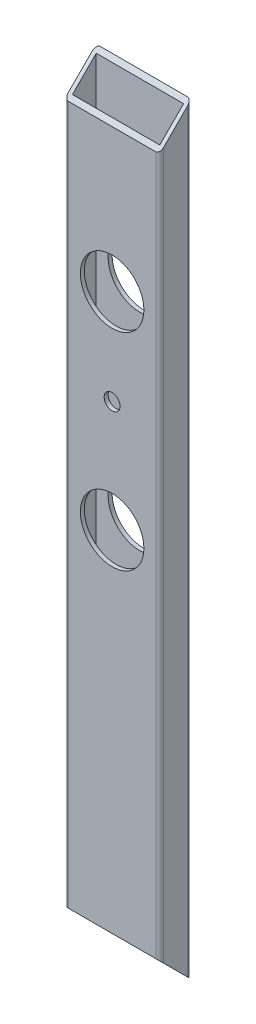
ISO-10303-21;
HEADER;
FILE_DESCRIPTION(('STEP AP214'),'2;1');
FILE_NAME('part.step','',(''),(''),'','','');
FILE_SCHEMA(('AUTOMOTIVE_DESIGN { 1 0 10303 214 1 1 1 1 }'));
ENDSEC;
DATA;
#1=APPLICATION_CONTEXT('core data for automotive mechanical design processes');
#2=APPLICATION_PROTOCOL_DEFINITION('international standard','automotive_design',2000,#1);
#3=PRODUCT_CONTEXT('',#1,'mechanical');
#4=PRODUCT('Part','Part','',(#3));
#5=PRODUCT_RELATED_PRODUCT_CATEGORY('part','',(#4));
#6=PRODUCT_DEFINITION_FORMATION('','',#4);
#7=PRODUCT_DEFINITION_CONTEXT('part definition',#1,'design');
#8=PRODUCT_DEFINITION('design','',#6,#7);
#9=PRODUCT_DEFINITION_SHAPE('','',#8);
#10=(LENGTH_UNIT() NAMED_UNIT(*) SI_UNIT(.MILLI.,.METRE.));
#11=(NAMED_UNIT(*) PLANE_ANGLE_UNIT() SI_UNIT($,.RADIAN.));
#12=(NAMED_UNIT(*) SI_UNIT($,.STERADIAN.) SOLID_ANGLE_UNIT());
#13=UNCERTAINTY_MEASURE_WITH_UNIT(LENGTH_MEASURE(1.E-05),#10,'distance_accuracy_value','');
#14=(GEOMETRIC_REPRESENTATION_CONTEXT(3) GLOBAL_UNCERTAINTY_ASSIGNED_CONTEXT((#13)) GLOBAL_UNIT_ASSIGNED_CONTEXT((#10,
#11,#12)) REPRESENTATION_CONTEXT('',''));
#15=CARTESIAN_POINT('',(0.,0.,0.));
#16=DIRECTION('',(0.,0.,1.));
#17=DIRECTION('',(1.,0.,0.));
#18=AXIS2_PLACEMENT_3D('',#15,#16,#17);
#19=CARTESIAN_POINT('',(1.5875,304.8,-1.5875));
#20=DIRECTION('',(0.,-1.,0.));
#21=DIRECTION('',(0.,0.,-1.));
#22=AXIS2_PLACEMENT_3D('',#19,#20,#21);
#23=CYLINDRICAL_SURFACE('',#22,1.5875);
#24=DIRECTION('',(0.,-1.,0.));
#25=VECTOR('',#24,1.);
#26=CARTESIAN_POINT('',(0.,304.8,-1.58750000000001));
#27=LINE('',#26,#25);
#28=CARTESIAN_POINT('',(0.,293.6875,-1.58750000000002));
#29=VERTEX_POINT('',#28);
#30=CARTESIAN_POINT('',(0.,11.1125,-1.5875));
#31=VERTEX_POINT('',#30);
#32=EDGE_CURVE('E205',#29,#31,#27,.T.);
#33=ORIENTED_EDGE('',*,*,#32,.T.);
#34=CARTESIAN_POINT('',(1.5875,11.1125,-1.5875));
#35=DIRECTION('',(0.,0.707106781186547,-0.707106781186547));
#36=DIRECTION('',(0.,-0.707106781186548,-0.707106781186548));
#37=AXIS2_PLACEMENT_3D('',#34,#35,#36);
#38=ELLIPSE('',#37,2.24506403026729,1.5875);
#39=CARTESIAN_POINT('',(1.58750000000001,12.7,0.));
#40=VERTEX_POINT('',#39);
#41=EDGE_CURVE('E56',#31,#40,#38,.T.);
#42=ORIENTED_EDGE('',*,*,#41,.T.);
#43=DIRECTION('',(0.,-1.,0.));
#44=VECTOR('',#43,1.);
#45=CARTESIAN_POINT('',(1.58750000000001,304.8,0.));
#46=LINE('',#45,#44);
#47=CARTESIAN_POINT('',(1.58750000000001,292.1,0.));
#48=VERTEX_POINT('',#47);
#49=EDGE_CURVE('E148',#48,#40,#46,.T.);
#50=ORIENTED_EDGE('',*,*,#49,.F.);
#51=CARTESIAN_POINT('',(1.5875,293.6875,-1.5875));
#52=DIRECTION('',(0.,-0.707106781186548,-0.707106781186547));
#53=DIRECTION('',(0.,-0.707106781186547,0.707106781186548));
#54=AXIS2_PLACEMENT_3D('',#51,#52,#53);
#55=ELLIPSE('',#54,2.24506403026729,1.5875);
#56=EDGE_CURVE('E130',#48,#29,#55,.T.);
#57=ORIENTED_EDGE('',*,*,#56,.T.);
#58=EDGE_LOOP('',(#33,#42,#50,#57));
#59=FACE_BOUND('',#58,.T.);
#60=ADVANCED_FACE('F34',(#59),#23,.T.);
#61=CARTESIAN_POINT('',(1.58750000000001,304.8,0.));
#62=DIRECTION('',(0.,0.,-1.));
#63=DIRECTION('',(-1.,0.,0.));
#64=AXIS2_PLACEMENT_3D('',#61,#62,#63);
#65=PLANE('',#64);
#66=CARTESIAN_POINT('',(19.05,152.4,0.));
#67=DIRECTION('',(0.,0.,1.));
#68=DIRECTION('',(1.,0.,0.));
#69=AXIS2_PLACEMENT_3D('',#66,#67,#68);
#70=CIRCLE('',#69,12.7);
#71=CARTESIAN_POINT('',(31.75,152.4,0.));
#72=VERTEX_POINT('',#71);
#73=EDGE_CURVE('E237',#72,#72,#70,.T.);
#74=ORIENTED_EDGE('',*,*,#73,.F.);
#75=EDGE_LOOP('',(#74));
#76=FACE_BOUND('',#75,.T.);
#77=CARTESIAN_POINT('',(19.05,196.85,0.));
#78=DIRECTION('',(0.,0.,1.));
#79=DIRECTION('',(1.,0.,0.));
#80=AXIS2_PLACEMENT_3D('',#77,#78,#79);
#81=CIRCLE('',#80,3.175);
#82=CARTESIAN_POINT('',(22.225,196.85,0.));
#83=VERTEX_POINT('',#82);
#84=EDGE_CURVE('E243',#83,#83,#81,.T.);
#85=ORIENTED_EDGE('',*,*,#84,.F.);
#86=EDGE_LOOP('',(#85));
#87=FACE_BOUND('',#86,.T.);
#88=CARTESIAN_POINT('',(19.05,234.95,0.));
#89=DIRECTION('',(0.,0.,1.));
#90=DIRECTION('',(1.,0.,0.));
#91=AXIS2_PLACEMENT_3D('',#88,#89,#90);
#92=CIRCLE('',#91,12.7);
#93=CARTESIAN_POINT('',(31.75,234.95,0.));
#94=VERTEX_POINT('',#93);
#95=EDGE_CURVE('E234',#94,#94,#92,.T.);
#96=ORIENTED_EDGE('',*,*,#95,.F.);
#97=EDGE_LOOP('',(#96));
#98=FACE_BOUND('',#97,.T.);
#99=ORIENTED_EDGE('',*,*,#49,.T.);
#100=DIRECTION('',(1.,0.,0.));
#101=VECTOR('',#100,1.);
#102=CARTESIAN_POINT('',(0.,12.7,0.));
#103=LINE('',#102,#101);
#104=CARTESIAN_POINT('',(36.5125,12.7,0.));
#105=VERTEX_POINT('',#104);
#106=EDGE_CURVE('E188',#40,#105,#103,.T.);
#107=ORIENTED_EDGE('',*,*,#106,.T.);
#108=DIRECTION('',(0.,-1.,0.));
#109=VECTOR('',#108,1.);
#110=CARTESIAN_POINT('',(36.5125,304.8,0.));
#111=LINE('',#110,#109);
#112=CARTESIAN_POINT('',(36.5125,292.1,0.));
#113=VERTEX_POINT('',#112);
#114=EDGE_CURVE('E146',#113,#105,#111,.T.);
#115=ORIENTED_EDGE('',*,*,#114,.F.);
#116=DIRECTION('',(1.,0.,0.));
#117=VECTOR('',#116,1.);
#118=CARTESIAN_POINT('',(0.,292.1,0.));
#119=LINE('',#118,#117);
#120=EDGE_CURVE('E125',#48,#113,#119,.T.);
#121=ORIENTED_EDGE('',*,*,#120,.F.);
#122=EDGE_LOOP('',(#99,#107,#115,#121));
#123=FACE_BOUND('',#122,.T.);
#124=ADVANCED_FACE('F279',(#76,#87,#98,#123),#65,.F.);
#125=CARTESIAN_POINT('',(36.5125,304.8,-1.5875));
#126=DIRECTION('',(0.,-1.,0.));
#127=DIRECTION('',(0.,0.,-1.));
#128=AXIS2_PLACEMENT_3D('',#125,#126,#127);
#129=CYLINDRICAL_SURFACE('',#128,1.5875);
#130=ORIENTED_EDGE('',*,*,#114,.T.);
#131=CARTESIAN_POINT('',(36.5125,11.1125,-1.5875));
#132=DIRECTION('',(0.,0.707106781186547,-0.707106781186547));
#133=DIRECTION('',(0.,-0.707106781186548,-0.707106781186548));
#134=AXIS2_PLACEMENT_3D('',#131,#132,#133);
#135=ELLIPSE('',#134,2.24506403026729,1.5875);
#136=CARTESIAN_POINT('',(38.1,11.1125,-1.58750000000003));
#137=VERTEX_POINT('',#136);
#138=EDGE_CURVE('E145',#105,#137,#135,.T.);
#139=ORIENTED_EDGE('',*,*,#138,.T.);
#140=DIRECTION('',(0.,-1.,0.));
#141=VECTOR('',#140,1.);
#142=CARTESIAN_POINT('',(38.1,304.8,-1.58750000000001));
#143=LINE('',#142,#141);
#144=CARTESIAN_POINT('',(38.1,293.6875,-1.58750000000002));
#145=VERTEX_POINT('',#144);
#146=EDGE_CURVE('E138',#145,#137,#143,.T.);
#147=ORIENTED_EDGE('',*,*,#146,.F.);
#148=CARTESIAN_POINT('',(36.5125,293.6875,-1.5875));
#149=DIRECTION('',(0.,-0.707106781186548,-0.707106781186547));
#150=DIRECTION('',(0.,-0.707106781186547,0.707106781186548));
#151=AXIS2_PLACEMENT_3D('',#148,#149,#150);
#152=ELLIPSE('',#151,2.24506403026729,1.5875);
#153=EDGE_CURVE('E119',#145,#113,#152,.T.);
#154=ORIENTED_EDGE('',*,*,#153,.T.);
#155=EDGE_LOOP('',(#130,#139,#147,#154));
#156=FACE_BOUND('',#155,.T.);
#157=ADVANCED_FACE('F144',(#156),#129,.T.);
#158=CARTESIAN_POINT('',(38.1,304.8,-1.58750000000001));
#159=DIRECTION('',(-1.,0.,0.));
#160=DIRECTION('',(0.,0.,1.));
#161=AXIS2_PLACEMENT_3D('',#158,#159,#160);
#162=PLANE('',#161);
#163=ORIENTED_EDGE('',*,*,#146,.T.);
#164=DIRECTION('',(0.,0.707106781186547,0.707106781186547));
#165=VECTOR('',#164,1.);
#166=CARTESIAN_POINT('',(38.1,0.,-12.7));
#167=LINE('',#166,#165);
#168=CARTESIAN_POINT('',(38.1,1.58750000000019,-11.1124999999999));
#169=VERTEX_POINT('',#168);
#170=EDGE_CURVE('E292',#169,#137,#167,.T.);
#171=ORIENTED_EDGE('',*,*,#170,.F.);
#172=DIRECTION('',(0.,-1.,0.));
#173=VECTOR('',#172,1.);
#174=CARTESIAN_POINT('',(38.1,304.8,-11.1125));
#175=LINE('',#174,#173);
#176=CARTESIAN_POINT('',(38.1,303.2125,-11.1125));
#177=VERTEX_POINT('',#176);
#178=EDGE_CURVE('E140',#177,#169,#175,.T.);
#179=ORIENTED_EDGE('',*,*,#178,.F.);
#180=DIRECTION('',(0.,0.707106781186547,-0.707106781186548));
#181=VECTOR('',#180,1.);
#182=CARTESIAN_POINT('',(38.1,304.8,-12.7));
#183=LINE('',#182,#181);
#184=EDGE_CURVE('E122',#145,#177,#183,.T.);
#185=ORIENTED_EDGE('',*,*,#184,.F.);
#186=EDGE_LOOP('',(#163,#171,#179,#185));
#187=FACE_BOUND('',#186,.T.);
#188=ADVANCED_FACE('F136',(#187),#162,.F.);
#189=CARTESIAN_POINT('',(36.5125,304.8,-11.1125));
#190=DIRECTION('',(0.,-1.,0.));
#191=DIRECTION('',(0.,0.,-1.));
#192=AXIS2_PLACEMENT_3D('',#189,#190,#191);
#193=CYLINDRICAL_SURFACE('',#192,1.5875);
#194=ORIENTED_EDGE('',*,*,#178,.T.);
#195=CARTESIAN_POINT('',(36.5125,1.58750000000002,-11.1125));
#196=DIRECTION('',(0.,0.707106781186547,-0.707106781186547));
#197=DIRECTION('',(0.,-0.707106781186548,-0.707106781186548));
#198=AXIS2_PLACEMENT_3D('',#195,#196,#197);
#199=ELLIPSE('',#198,2.24506403026729,1.5875);
#200=CARTESIAN_POINT('',(36.5125,0.,-12.7));
#201=VERTEX_POINT('',#200);
#202=EDGE_CURVE('E224',#169,#201,#199,.T.);
#203=ORIENTED_EDGE('',*,*,#202,.T.);
#204=DIRECTION('',(0.,-1.,0.));
#205=VECTOR('',#204,1.);
#206=CARTESIAN_POINT('',(36.5125,304.8,-12.7));
#207=LINE('',#206,#205);
#208=CARTESIAN_POINT('',(36.5125,304.8,-12.7));
#209=VERTEX_POINT('',#208);
#210=EDGE_CURVE('E150',#209,#201,#207,.T.);
#211=ORIENTED_EDGE('',*,*,#210,.F.);
#212=CARTESIAN_POINT('',(36.5125,303.2125,-11.1125));
#213=DIRECTION('',(0.,-0.707106781186548,-0.707106781186547));
#214=DIRECTION('',(0.,-0.707106781186547,0.707106781186548));
#215=AXIS2_PLACEMENT_3D('',#212,#213,#214);
#216=ELLIPSE('',#215,2.24506403026729,1.5875);
#217=EDGE_CURVE('E131',#209,#177,#216,.T.);
#218=ORIENTED_EDGE('',*,*,#217,.T.);
#219=EDGE_LOOP('',(#194,#203,#211,#218));
#220=FACE_BOUND('',#219,.T.);
#221=ADVANCED_FACE('F223',(#220),#193,.T.);
#222=CARTESIAN_POINT('',(1.58750000000001,304.8,-12.7));
#223=DIRECTION('',(0.,0.,1.));
#224=DIRECTION('',(1.,0.,0.));
#225=AXIS2_PLACEMENT_3D('',#222,#223,#224);
#226=PLANE('',#225);
#227=CARTESIAN_POINT('',(19.05,152.4,-12.7));
#228=DIRECTION('',(0.,0.,1.));
#229=DIRECTION('',(1.,0.,0.));
#230=AXIS2_PLACEMENT_3D('',#227,#228,#229);
#231=CIRCLE('',#230,12.7);
#232=CARTESIAN_POINT('',(31.75,152.4,-12.7));
#233=VERTEX_POINT('',#232);
#234=EDGE_CURVE('E160',#233,#233,#231,.T.);
#235=ORIENTED_EDGE('',*,*,#234,.T.);
#236=EDGE_LOOP('',(#235));
#237=FACE_BOUND('',#236,.T.);
#238=CARTESIAN_POINT('',(19.05,196.85,-12.7));
#239=DIRECTION('',(0.,0.,1.));
#240=DIRECTION('',(1.,0.,0.));
#241=AXIS2_PLACEMENT_3D('',#238,#239,#240);
#242=CIRCLE('',#241,3.175);
#243=CARTESIAN_POINT('',(22.225,196.85,-12.7));
#244=VERTEX_POINT('',#243);
#245=EDGE_CURVE('E240',#244,#244,#242,.T.);
#246=ORIENTED_EDGE('',*,*,#245,.T.);
#247=EDGE_LOOP('',(#246));
#248=FACE_BOUND('',#247,.T.);
#249=CARTESIAN_POINT('',(19.05,234.95,-12.7));
#250=DIRECTION('',(0.,0.,1.));
#251=DIRECTION('',(1.,0.,0.));
#252=AXIS2_PLACEMENT_3D('',#249,#250,#251);
#253=CIRCLE('',#252,12.7);
#254=CARTESIAN_POINT('',(31.75,234.95,-12.7));
#255=VERTEX_POINT('',#254);
#256=EDGE_CURVE('E246',#255,#255,#253,.T.);
#257=ORIENTED_EDGE('',*,*,#256,.T.);
#258=EDGE_LOOP('',(#257));
#259=FACE_BOUND('',#258,.T.);
#260=DIRECTION('',(-1.,0.,0.));
#261=VECTOR('',#260,1.);
#262=CARTESIAN_POINT('',(1.58750000000001,0.,-12.7));
#263=LINE('',#262,#261);
#264=CARTESIAN_POINT('',(1.5875,0.,-12.7));
#265=VERTEX_POINT('',#264);
#266=EDGE_CURVE('E202',#201,#265,#263,.T.);
#267=ORIENTED_EDGE('',*,*,#266,.T.);
#268=DIRECTION('',(0.,-1.,0.));
#269=VECTOR('',#268,1.);
#270=CARTESIAN_POINT('',(1.58750000000001,304.8,-12.7));
#271=LINE('',#270,#269);
#272=CARTESIAN_POINT('',(1.5875,304.8,-12.7));
#273=VERTEX_POINT('',#272);
#274=EDGE_CURVE('E213',#273,#265,#271,.T.);
#275=ORIENTED_EDGE('',*,*,#274,.F.);
#276=DIRECTION('',(-1.,0.,0.));
#277=VECTOR('',#276,1.);
#278=CARTESIAN_POINT('',(1.58750000000001,304.8,-12.7));
#279=LINE('',#278,#277);
#280=EDGE_CURVE('E203',#209,#273,#279,.T.);
#281=ORIENTED_EDGE('',*,*,#280,.F.);
#282=ORIENTED_EDGE('',*,*,#210,.T.);
#283=EDGE_LOOP('',(#267,#275,#281,#282));
#284=FACE_BOUND('',#283,.T.);
#285=ADVANCED_FACE('F219',(#237,#248,#259,#284),#226,.F.);
#286=CARTESIAN_POINT('',(1.5875,304.8,-11.1125));
#287=DIRECTION('',(0.,-1.,0.));
#288=DIRECTION('',(0.,0.,-1.));
#289=AXIS2_PLACEMENT_3D('',#286,#287,#288);
#290=CYLINDRICAL_SURFACE('',#289,1.5875);
#291=ORIENTED_EDGE('',*,*,#274,.T.);
#292=CARTESIAN_POINT('',(1.5875,1.58750000000002,-11.1125));
#293=DIRECTION('',(0.,0.707106781186547,-0.707106781186547));
#294=DIRECTION('',(0.,-0.707106781186548,-0.707106781186548));
#295=AXIS2_PLACEMENT_3D('',#292,#293,#294);
#296=ELLIPSE('',#295,2.24506403026729,1.5875);
#297=CARTESIAN_POINT('',(0.,1.5875,-11.1125));
#298=VERTEX_POINT('',#297);
#299=EDGE_CURVE('E225',#265,#298,#296,.T.);
#300=ORIENTED_EDGE('',*,*,#299,.T.);
#301=DIRECTION('',(0.,-1.,0.));
#302=VECTOR('',#301,1.);
#303=CARTESIAN_POINT('',(0.,304.8,-11.1125));
#304=LINE('',#303,#302);
#305=CARTESIAN_POINT('',(0.,303.2125,-11.1125));
#306=VERTEX_POINT('',#305);
#307=EDGE_CURVE('E210',#306,#298,#304,.T.);
#308=ORIENTED_EDGE('',*,*,#307,.F.);
#309=CARTESIAN_POINT('',(1.5875,303.2125,-11.1125));
#310=DIRECTION('',(0.,-0.707106781186548,-0.707106781186547));
#311=DIRECTION('',(0.,-0.707106781186547,0.707106781186548));
#312=AXIS2_PLACEMENT_3D('',#309,#310,#311);
#313=ELLIPSE('',#312,2.24506403026729,1.5875);
#314=EDGE_CURVE('E48',#306,#273,#313,.T.);
#315=ORIENTED_EDGE('',*,*,#314,.T.);
#316=EDGE_LOOP('',(#291,#300,#308,#315));
#317=FACE_BOUND('',#316,.T.);
#318=ADVANCED_FACE('F318',(#317),#290,.T.);
#319=CARTESIAN_POINT('',(0.,304.8,-1.58750000000001));
#320=DIRECTION('',(1.,0.,0.));
#321=DIRECTION('',(0.,0.,-1.));
#322=AXIS2_PLACEMENT_3D('',#319,#320,#321);
#323=PLANE('',#322);
#324=ORIENTED_EDGE('',*,*,#307,.T.);
#325=DIRECTION('',(0.,0.707106781186547,0.707106781186547));
#326=VECTOR('',#325,1.);
#327=CARTESIAN_POINT('',(0.,0.,-12.7));
#328=LINE('',#327,#326);
#329=EDGE_CURVE('E291',#298,#31,#328,.T.);
#330=ORIENTED_EDGE('',*,*,#329,.T.);
#331=ORIENTED_EDGE('',*,*,#32,.F.);
#332=DIRECTION('',(0.,0.707106781186547,-0.707106781186548));
#333=VECTOR('',#332,1.);
#334=CARTESIAN_POINT('',(0.,304.8,-12.7));
#335=LINE('',#334,#333);
#336=EDGE_CURVE('E141',#29,#306,#335,.T.);
#337=ORIENTED_EDGE('',*,*,#336,.T.);
#338=EDGE_LOOP('',(#324,#330,#331,#337));
#339=FACE_BOUND('',#338,.T.);
#340=ADVANCED_FACE('F289',(#339),#323,.F.);
#341=CARTESIAN_POINT('',(1.5875,304.8,-1.5875));
#342=DIRECTION('',(1.,0.,0.));
#343=DIRECTION('',(0.,0.,-1.));
#344=AXIS2_PLACEMENT_3D('',#341,#342,#343);
#345=PLANE('',#344);
#346=DIRECTION('',(0.,0.707106781186548,0.707106781186548));
#347=VECTOR('',#346,1.);
#348=CARTESIAN_POINT('',(1.5875,157.95625,145.25625));
#349=LINE('',#348,#347);
#350=CARTESIAN_POINT('',(1.5875,1.58750000000002,-11.1125));
#351=VERTEX_POINT('',#350);
#352=CARTESIAN_POINT('',(1.5875,11.1125,-1.5875));
#353=VERTEX_POINT('',#352);
#354=EDGE_CURVE('E229',#351,#353,#349,.T.);
#355=ORIENTED_EDGE('',*,*,#354,.F.);
#356=DIRECTION('',(0.,-1.,0.));
#357=VECTOR('',#356,1.);
#358=CARTESIAN_POINT('',(1.5875,304.8,-11.1125));
#359=LINE('',#358,#357);
#360=CARTESIAN_POINT('',(1.5875,303.2125,-11.1125));
#361=VERTEX_POINT('',#360);
#362=EDGE_CURVE('E193',#361,#351,#359,.T.);
#363=ORIENTED_EDGE('',*,*,#362,.F.);
#364=DIRECTION('',(0.,0.707106781186547,-0.707106781186548));
#365=VECTOR('',#364,1.);
#366=CARTESIAN_POINT('',(1.5875,299.24375,-7.14375));
#367=LINE('',#366,#365);
#368=CARTESIAN_POINT('',(1.5875,293.6875,-1.5875));
#369=VERTEX_POINT('',#368);
#370=EDGE_CURVE('E174',#369,#361,#367,.T.);
#371=ORIENTED_EDGE('',*,*,#370,.F.);
#372=DIRECTION('',(0.,-1.,0.));
#373=VECTOR('',#372,1.);
#374=CARTESIAN_POINT('',(1.5875,304.8,-1.5875));
#375=LINE('',#374,#373);
#376=EDGE_CURVE('E195',#369,#353,#375,.T.);
#377=ORIENTED_EDGE('',*,*,#376,.T.);
#378=EDGE_LOOP('',(#355,#363,#371,#377));
#379=FACE_BOUND('',#378,.T.);
#380=ADVANCED_FACE('F263',(#379),#345,.T.);
#381=CARTESIAN_POINT('',(1.5875,304.8,-1.5875));
#382=DIRECTION('',(0.,0.,-1.));
#383=DIRECTION('',(-1.,0.,0.));
#384=AXIS2_PLACEMENT_3D('',#381,#382,#383);
#385=PLANE('',#384);
#386=DIRECTION('',(1.,0.,0.));
#387=VECTOR('',#386,1.);
#388=CARTESIAN_POINT('',(1.5875,11.1125,-1.5875));
#389=LINE('',#388,#387);
#390=CARTESIAN_POINT('',(36.5125,11.1125,-1.58749999999999));
#391=VERTEX_POINT('',#390);
#392=EDGE_CURVE('E306',#353,#391,#389,.T.);
#393=ORIENTED_EDGE('',*,*,#392,.F.);
#394=ORIENTED_EDGE('',*,*,#376,.F.);
#395=DIRECTION('',(-1.,0.,0.));
#396=VECTOR('',#395,1.);
#397=CARTESIAN_POINT('',(1.5875,293.6875,-1.5875));
#398=LINE('',#397,#396);
#399=CARTESIAN_POINT('',(36.5125,293.6875,-1.5875));
#400=VERTEX_POINT('',#399);
#401=EDGE_CURVE('E187',#400,#369,#398,.T.);
#402=ORIENTED_EDGE('',*,*,#401,.F.);
#403=DIRECTION('',(0.,-1.,0.));
#404=VECTOR('',#403,1.);
#405=CARTESIAN_POINT('',(36.5125,304.8,-1.5875));
#406=LINE('',#405,#404);
#407=EDGE_CURVE('E186',#400,#391,#406,.T.);
#408=ORIENTED_EDGE('',*,*,#407,.T.);
#409=EDGE_LOOP('',(#393,#394,#402,#408));
#410=FACE_BOUND('',#409,.T.);
#411=CARTESIAN_POINT('',(19.05,152.4,-1.5875));
#412=DIRECTION('',(0.,0.,-1.));
#413=DIRECTION('',(-1.,0.,0.));
#414=AXIS2_PLACEMENT_3D('',#411,#412,#413);
#415=CIRCLE('',#414,12.7);
#416=CARTESIAN_POINT('',(6.35,152.4,-1.5875));
#417=VERTEX_POINT('',#416);
#418=EDGE_CURVE('E167',#417,#417,#415,.T.);
#419=ORIENTED_EDGE('',*,*,#418,.F.);
#420=EDGE_LOOP('',(#419));
#421=FACE_BOUND('',#420,.T.);
#422=CARTESIAN_POINT('',(19.05,196.85,-1.5875));
#423=DIRECTION('',(0.,0.,-1.));
#424=DIRECTION('',(-1.,0.,0.));
#425=AXIS2_PLACEMENT_3D('',#422,#423,#424);
#426=CIRCLE('',#425,3.175);
#427=CARTESIAN_POINT('',(15.875,196.85,-1.5875));
#428=VERTEX_POINT('',#427);
#429=EDGE_CURVE('E164',#428,#428,#426,.T.);
#430=ORIENTED_EDGE('',*,*,#429,.F.);
#431=EDGE_LOOP('',(#430));
#432=FACE_BOUND('',#431,.T.);
#433=CARTESIAN_POINT('',(19.05,234.95,-1.5875));
#434=DIRECTION('',(0.,0.,-1.));
#435=DIRECTION('',(-1.,0.,0.));
#436=AXIS2_PLACEMENT_3D('',#433,#434,#435);
#437=CIRCLE('',#436,12.7);
#438=CARTESIAN_POINT('',(6.35,234.95,-1.5875));
#439=VERTEX_POINT('',#438);
#440=EDGE_CURVE('E159',#439,#439,#437,.T.);
#441=ORIENTED_EDGE('',*,*,#440,.F.);
#442=EDGE_LOOP('',(#441));
#443=FACE_BOUND('',#442,.T.);
#444=ADVANCED_FACE('F260',(#410,#421,#432,#443),#385,.T.);
#445=CARTESIAN_POINT('',(36.5125,304.8,-1.5875));
#446=DIRECTION('',(-1.,0.,0.));
#447=DIRECTION('',(0.,0.,1.));
#448=AXIS2_PLACEMENT_3D('',#445,#446,#447);
#449=PLANE('',#448);
#450=DIRECTION('',(0.,-0.707106781186547,-0.707106781186547));
#451=VECTOR('',#450,1.);
#452=CARTESIAN_POINT('',(36.5125,157.95625,145.25625));
#453=LINE('',#452,#451);
#454=CARTESIAN_POINT('',(36.5125,1.58750000000013,-11.1125));
#455=VERTEX_POINT('',#454);
#456=EDGE_CURVE('E304',#391,#455,#453,.T.);
#457=ORIENTED_EDGE('',*,*,#456,.F.);
#458=ORIENTED_EDGE('',*,*,#407,.F.);
#459=DIRECTION('',(0.,-0.707106781186547,0.707106781186548));
#460=VECTOR('',#459,1.);
#461=CARTESIAN_POINT('',(36.5125,299.24375,-7.14375));
#462=LINE('',#461,#460);
#463=CARTESIAN_POINT('',(36.5125,303.2125,-11.1125));
#464=VERTEX_POINT('',#463);
#465=EDGE_CURVE('E171',#464,#400,#462,.T.);
#466=ORIENTED_EDGE('',*,*,#465,.F.);
#467=DIRECTION('',(0.,-1.,0.));
#468=VECTOR('',#467,1.);
#469=CARTESIAN_POINT('',(36.5125,304.8,-11.1125));
#470=LINE('',#469,#468);
#471=EDGE_CURVE('E184',#464,#455,#470,.T.);
#472=ORIENTED_EDGE('',*,*,#471,.T.);
#473=EDGE_LOOP('',(#457,#458,#466,#472));
#474=FACE_BOUND('',#473,.T.);
#475=ADVANCED_FACE('F183',(#474),#449,.T.);
#476=CARTESIAN_POINT('',(1.5875,304.8,-11.1125));
#477=DIRECTION('',(0.,0.,1.));
#478=DIRECTION('',(1.,0.,0.));
#479=AXIS2_PLACEMENT_3D('',#476,#477,#478);
#480=PLANE('',#479);
#481=DIRECTION('',(-1.,0.,0.));
#482=VECTOR('',#481,1.);
#483=CARTESIAN_POINT('',(1.58750000000006,1.58750000000002,-11.1125));
#484=LINE('',#483,#482);
#485=EDGE_CURVE('E11',#455,#351,#484,.T.);
#486=ORIENTED_EDGE('',*,*,#485,.F.);
#487=ORIENTED_EDGE('',*,*,#471,.F.);
#488=DIRECTION('',(1.,0.,0.));
#489=VECTOR('',#488,1.);
#490=CARTESIAN_POINT('',(1.5875,303.2125,-11.1125));
#491=LINE('',#490,#489);
#492=EDGE_CURVE('E41',#361,#464,#491,.T.);
#493=ORIENTED_EDGE('',*,*,#492,.F.);
#494=ORIENTED_EDGE('',*,*,#362,.T.);
#495=EDGE_LOOP('',(#486,#487,#493,#494));
#496=FACE_BOUND('',#495,.T.);
#497=CARTESIAN_POINT('',(19.05,152.4,-11.1125));
#498=DIRECTION('',(0.,0.,1.));
#499=DIRECTION('',(1.,0.,0.));
#500=AXIS2_PLACEMENT_3D('',#497,#498,#499);
#501=CIRCLE('',#500,12.7);
#502=CARTESIAN_POINT('',(31.75,152.4,-11.1125));
#503=VERTEX_POINT('',#502);
#504=EDGE_CURVE('E165',#503,#503,#501,.T.);
#505=ORIENTED_EDGE('',*,*,#504,.F.);
#506=EDGE_LOOP('',(#505));
#507=FACE_BOUND('',#506,.T.);
#508=CARTESIAN_POINT('',(19.05,196.85,-11.1125));
#509=DIRECTION('',(0.,0.,1.));
#510=DIRECTION('',(1.,0.,0.));
#511=AXIS2_PLACEMENT_3D('',#508,#509,#510);
#512=CIRCLE('',#511,3.175);
#513=CARTESIAN_POINT('',(22.225,196.85,-11.1125));
#514=VERTEX_POINT('',#513);
#515=EDGE_CURVE('E161',#514,#514,#512,.T.);
#516=ORIENTED_EDGE('',*,*,#515,.F.);
#517=EDGE_LOOP('',(#516));
#518=FACE_BOUND('',#517,.T.);
#519=CARTESIAN_POINT('',(19.05,234.95,-11.1125));
#520=DIRECTION('',(0.,0.,1.));
#521=DIRECTION('',(1.,0.,0.));
#522=AXIS2_PLACEMENT_3D('',#519,#520,#521);
#523=CIRCLE('',#522,12.7);
#524=CARTESIAN_POINT('',(31.75,234.95,-11.1125));
#525=VERTEX_POINT('',#524);
#526=EDGE_CURVE('E156',#525,#525,#523,.T.);
#527=ORIENTED_EDGE('',*,*,#526,.F.);
#528=EDGE_LOOP('',(#527));
#529=FACE_BOUND('',#528,.T.);
#530=ADVANCED_FACE('F191',(#496,#507,#518,#529),#480,.T.);
#531=CARTESIAN_POINT('',(19.05,234.95,-12.7));
#532=DIRECTION('',(0.,0.,1.));
#533=DIRECTION('',(1.,0.,0.));
#534=AXIS2_PLACEMENT_3D('',#531,#532,#533);
#535=CYLINDRICAL_SURFACE('',#534,12.7);
#536=ORIENTED_EDGE('',*,*,#526,.T.);
#537=EDGE_LOOP('',(#536));
#538=FACE_BOUND('',#537,.T.);
#539=ORIENTED_EDGE('',*,*,#256,.F.);
#540=EDGE_LOOP('',(#539));
#541=FACE_BOUND('',#540,.T.);
#542=ADVANCED_FACE('F276',(#538,#541),#535,.F.);
#543=CARTESIAN_POINT('',(19.05,196.85,-12.7));
#544=DIRECTION('',(0.,0.,1.));
#545=DIRECTION('',(1.,0.,0.));
#546=AXIS2_PLACEMENT_3D('',#543,#544,#545);
#547=CYLINDRICAL_SURFACE('',#546,3.175);
#548=ORIENTED_EDGE('',*,*,#515,.T.);
#549=EDGE_LOOP('',(#548));
#550=FACE_BOUND('',#549,.T.);
#551=ORIENTED_EDGE('',*,*,#245,.F.);
#552=EDGE_LOOP('',(#551));
#553=FACE_BOUND('',#552,.T.);
#554=ADVANCED_FACE('F417',(#550,#553),#547,.F.);
#555=CARTESIAN_POINT('',(19.05,152.4,-12.7));
#556=DIRECTION('',(0.,0.,1.));
#557=DIRECTION('',(1.,0.,0.));
#558=AXIS2_PLACEMENT_3D('',#555,#556,#557);
#559=CYLINDRICAL_SURFACE('',#558,12.7);
#560=ORIENTED_EDGE('',*,*,#504,.T.);
#561=EDGE_LOOP('',(#560));
#562=FACE_BOUND('',#561,.T.);
#563=ORIENTED_EDGE('',*,*,#234,.F.);
#564=EDGE_LOOP('',(#563));
#565=FACE_BOUND('',#564,.T.);
#566=ADVANCED_FACE('F274',(#562,#565),#559,.F.);
#567=ORIENTED_EDGE('',*,*,#440,.T.);
#568=EDGE_LOOP('',(#567));
#569=FACE_BOUND('',#568,.T.);
#570=ORIENTED_EDGE('',*,*,#95,.T.);
#571=EDGE_LOOP('',(#570));
#572=FACE_BOUND('',#571,.T.);
#573=ADVANCED_FACE('F270',(#569,#572),#535,.F.);
#574=ORIENTED_EDGE('',*,*,#429,.T.);
#575=EDGE_LOOP('',(#574));
#576=FACE_BOUND('',#575,.T.);
#577=ORIENTED_EDGE('',*,*,#84,.T.);
#578=EDGE_LOOP('',(#577));
#579=FACE_BOUND('',#578,.T.);
#580=ADVANCED_FACE('F273',(#576,#579),#547,.F.);
#581=ORIENTED_EDGE('',*,*,#418,.T.);
#582=EDGE_LOOP('',(#581));
#583=FACE_BOUND('',#582,.T.);
#584=ORIENTED_EDGE('',*,*,#73,.T.);
#585=EDGE_LOOP('',(#584));
#586=FACE_BOUND('',#585,.T.);
#587=ADVANCED_FACE('F257',(#583,#586),#559,.F.);
#588=CARTESIAN_POINT('',(0.,304.8,-12.7));
#589=DIRECTION('',(0.,-0.707106781186548,-0.707106781186547));
#590=DIRECTION('',(0.,0.707106781186547,-0.707106781186548));
#591=AXIS2_PLACEMENT_3D('',#588,#589,#590);
#592=PLANE('',#591);
#593=ORIENTED_EDGE('',*,*,#370,.T.);
#594=ORIENTED_EDGE('',*,*,#492,.T.);
#595=ORIENTED_EDGE('',*,*,#465,.T.);
#596=ORIENTED_EDGE('',*,*,#401,.T.);
#597=EDGE_LOOP('',(#593,#594,#595,#596));
#598=FACE_BOUND('',#597,.T.);
#599=ORIENTED_EDGE('',*,*,#120,.T.);
#600=ORIENTED_EDGE('',*,*,#153,.F.);
#601=ORIENTED_EDGE('',*,*,#184,.T.);
#602=ORIENTED_EDGE('',*,*,#217,.F.);
#603=ORIENTED_EDGE('',*,*,#280,.T.);
#604=ORIENTED_EDGE('',*,*,#314,.F.);
#605=ORIENTED_EDGE('',*,*,#336,.F.);
#606=ORIENTED_EDGE('',*,*,#56,.F.);
#607=EDGE_LOOP('',(#599,#600,#601,#602,#603,#604,#605,#606));
#608=FACE_BOUND('',#607,.T.);
#609=ADVANCED_FACE('F121',(#598,#608),#592,.F.);
#610=CARTESIAN_POINT('',(0.,0.,-12.7));
#611=DIRECTION('',(0.,0.707106781186547,-0.707106781186547));
#612=DIRECTION('',(0.,0.707106781186548,0.707106781186548));
#613=AXIS2_PLACEMENT_3D('',#610,#611,#612);
#614=PLANE('',#613);
#615=ORIENTED_EDGE('',*,*,#354,.T.);
#616=ORIENTED_EDGE('',*,*,#392,.T.);
#617=ORIENTED_EDGE('',*,*,#456,.T.);
#618=ORIENTED_EDGE('',*,*,#485,.T.);
#619=EDGE_LOOP('',(#615,#616,#617,#618));
#620=FACE_BOUND('',#619,.T.);
#621=ORIENTED_EDGE('',*,*,#329,.F.);
#622=ORIENTED_EDGE('',*,*,#299,.F.);
#623=ORIENTED_EDGE('',*,*,#266,.F.);
#624=ORIENTED_EDGE('',*,*,#202,.F.);
#625=ORIENTED_EDGE('',*,*,#170,.T.);
#626=ORIENTED_EDGE('',*,*,#138,.F.);
#627=ORIENTED_EDGE('',*,*,#106,.F.);
#628=ORIENTED_EDGE('',*,*,#41,.F.);
#629=EDGE_LOOP('',(#621,#622,#623,#624,#625,#626,#627,#628));
#630=FACE_BOUND('',#629,.T.);
#631=ADVANCED_FACE('F310',(#620,#630),#614,.F.);
#632=CLOSED_SHELL('',(#60,#124,#157,#188,#221,#285,#318,#340,#380,#444,#475,#530,#542,#554,#566,
#573,#580,#587,#609,#631));
#633=MANIFOLD_SOLID_BREP('B2',#632);
#634=ADVANCED_BREP_SHAPE_REPRESENTATION('',(#18,#633),#14);
#635=SHAPE_DEFINITION_REPRESENTATION(#9,#634);
ENDSEC;
END-ISO-10303-21;
